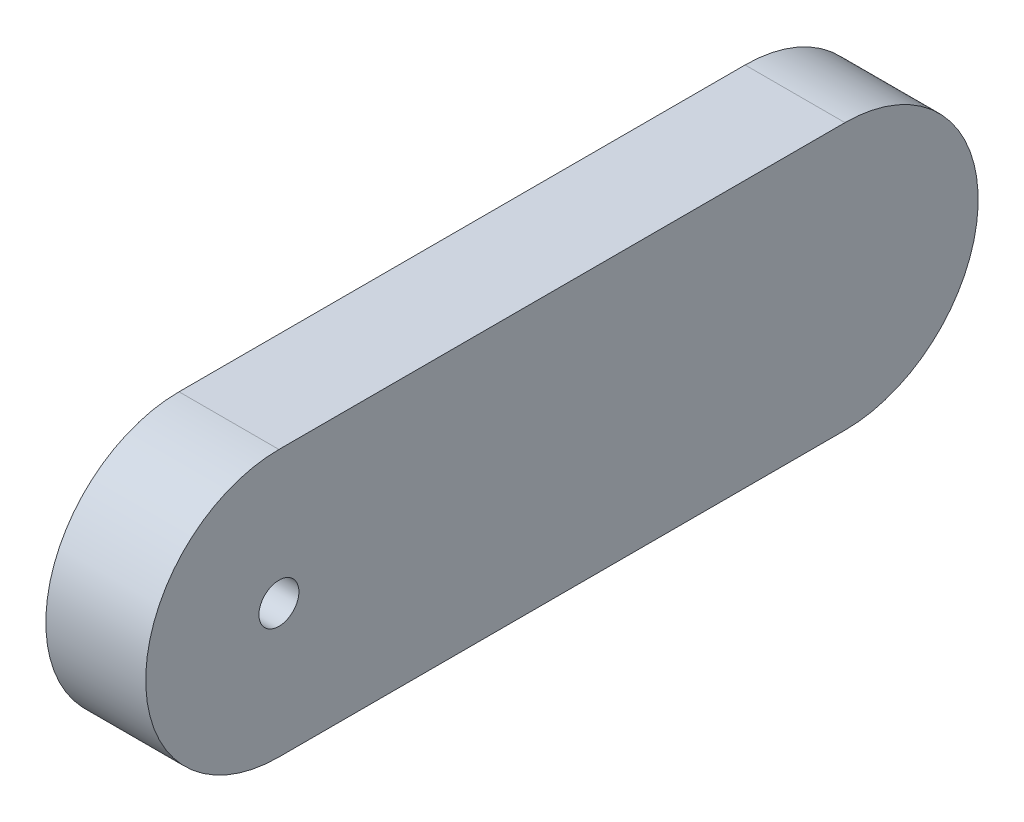
ISO-10303-21;
HEADER;
FILE_DESCRIPTION(('STEP AP214'),'2;1');
FILE_NAME('part.step','',(''),(''),'','','');
FILE_SCHEMA(('AUTOMOTIVE_DESIGN { 1 0 10303 214 1 1 1 1 }'));
ENDSEC;
DATA;
#1=APPLICATION_CONTEXT('core data for automotive mechanical design processes');
#2=APPLICATION_PROTOCOL_DEFINITION('international standard','automotive_design',2000,#1);
#3=PRODUCT_CONTEXT('',#1,'mechanical');
#4=PRODUCT('Part','Part','',(#3));
#5=PRODUCT_RELATED_PRODUCT_CATEGORY('part','',(#4));
#6=PRODUCT_DEFINITION_FORMATION('','',#4);
#7=PRODUCT_DEFINITION_CONTEXT('part definition',#1,'design');
#8=PRODUCT_DEFINITION('design','',#6,#7);
#9=PRODUCT_DEFINITION_SHAPE('','',#8);
#10=(LENGTH_UNIT() NAMED_UNIT(*) SI_UNIT(.MILLI.,.METRE.));
#11=(NAMED_UNIT(*) PLANE_ANGLE_UNIT() SI_UNIT($,.RADIAN.));
#12=(NAMED_UNIT(*) SI_UNIT($,.STERADIAN.) SOLID_ANGLE_UNIT());
#13=UNCERTAINTY_MEASURE_WITH_UNIT(LENGTH_MEASURE(1.E-05),#10,'distance_accuracy_value','');
#14=(GEOMETRIC_REPRESENTATION_CONTEXT(3) GLOBAL_UNCERTAINTY_ASSIGNED_CONTEXT((#13)) GLOBAL_UNIT_ASSIGNED_CONTEXT((#10,
#11,#12)) REPRESENTATION_CONTEXT('',''));
#15=CARTESIAN_POINT('',(0.,0.,0.));
#16=DIRECTION('',(0.,0.,1.));
#17=DIRECTION('',(1.,0.,0.));
#18=AXIS2_PLACEMENT_3D('',#15,#16,#17);
#19=CARTESIAN_POINT('',(30.,0.,-250.));
#20=DIRECTION('',(0.,1.,0.));
#21=DIRECTION('',(0.,0.,1.));
#22=AXIS2_PLACEMENT_3D('',#19,#20,#21);
#23=PLANE('',#22);
#24=DIRECTION('',(-1.,0.,0.));
#25=VECTOR('',#24,1.);
#26=CARTESIAN_POINT('',(30.,0.,-210.));
#27=LINE('',#26,#25);
#28=CARTESIAN_POINT('',(30.,0.,-210.));
#29=VERTEX_POINT('',#28);
#30=CARTESIAN_POINT('',(0.,0.,-210.));
#31=VERTEX_POINT('',#30);
#32=EDGE_CURVE('E11',#29,#31,#27,.T.);
#33=ORIENTED_EDGE('',*,*,#32,.F.);
#34=DIRECTION('',(0.,0.,-1.));
#35=VECTOR('',#34,1.);
#36=CARTESIAN_POINT('',(30.,0.,-250.));
#37=LINE('',#36,#35);
#38=CARTESIAN_POINT('',(30.,0.,-40.));
#39=VERTEX_POINT('',#38);
#40=EDGE_CURVE('E37',#39,#29,#37,.T.);
#41=ORIENTED_EDGE('',*,*,#40,.F.);
#42=DIRECTION('',(-1.,0.,0.));
#43=VECTOR('',#42,1.);
#44=CARTESIAN_POINT('',(30.,0.,-40.));
#45=LINE('',#44,#43);
#46=CARTESIAN_POINT('',(0.,0.,-40.));
#47=VERTEX_POINT('',#46);
#48=EDGE_CURVE('E87',#39,#47,#45,.T.);
#49=ORIENTED_EDGE('',*,*,#48,.T.);
#50=DIRECTION('',(0.,0.,-1.));
#51=VECTOR('',#50,1.);
#52=CARTESIAN_POINT('',(0.,0.,-250.));
#53=LINE('',#52,#51);
#54=EDGE_CURVE('E163',#47,#31,#53,.T.);
#55=ORIENTED_EDGE('',*,*,#54,.T.);
#56=EDGE_LOOP('',(#33,#41,#49,#55));
#57=FACE_BOUND('',#56,.T.);
#58=ADVANCED_FACE('F34',(#57),#23,.F.);
#59=CARTESIAN_POINT('',(30.,80.,0.));
#60=DIRECTION('',(0.,-1.,0.));
#61=DIRECTION('',(0.,0.,-1.));
#62=AXIS2_PLACEMENT_3D('',#59,#60,#61);
#63=PLANE('',#62);
#64=DIRECTION('',(0.,0.,1.));
#65=VECTOR('',#64,1.);
#66=CARTESIAN_POINT('',(30.,80.,0.));
#67=LINE('',#66,#65);
#68=CARTESIAN_POINT('',(30.,80.0000000000001,-210.));
#69=VERTEX_POINT('',#68);
#70=CARTESIAN_POINT('',(30.,80.,-40.));
#71=VERTEX_POINT('',#70);
#72=EDGE_CURVE('E174',#69,#71,#67,.T.);
#73=ORIENTED_EDGE('',*,*,#72,.F.);
#74=DIRECTION('',(-1.,0.,0.));
#75=VECTOR('',#74,1.);
#76=CARTESIAN_POINT('',(30.,80.0000000000001,-210.));
#77=LINE('',#76,#75);
#78=CARTESIAN_POINT('',(0.,80.0000000000001,-210.));
#79=VERTEX_POINT('',#78);
#80=EDGE_CURVE('E166',#69,#79,#77,.T.);
#81=ORIENTED_EDGE('',*,*,#80,.T.);
#82=DIRECTION('',(0.,0.,1.));
#83=VECTOR('',#82,1.);
#84=CARTESIAN_POINT('',(0.,80.,0.));
#85=LINE('',#84,#83);
#86=CARTESIAN_POINT('',(0.,80.,-40.));
#87=VERTEX_POINT('',#86);
#88=EDGE_CURVE('E169',#79,#87,#85,.T.);
#89=ORIENTED_EDGE('',*,*,#88,.T.);
#90=DIRECTION('',(-1.,0.,0.));
#91=VECTOR('',#90,1.);
#92=CARTESIAN_POINT('',(30.,80.,-40.));
#93=LINE('',#92,#91);
#94=EDGE_CURVE('E160',#71,#87,#93,.T.);
#95=ORIENTED_EDGE('',*,*,#94,.F.);
#96=EDGE_LOOP('',(#73,#81,#89,#95));
#97=FACE_BOUND('',#96,.T.);
#98=ADVANCED_FACE('F194',(#97),#63,.F.);
#99=CARTESIAN_POINT('',(30.,0.,0.));
#100=DIRECTION('',(-1.,0.,0.));
#101=DIRECTION('',(0.,0.,1.));
#102=AXIS2_PLACEMENT_3D('',#99,#100,#101);
#103=PLANE('',#102);
#104=CARTESIAN_POINT('',(30.,40.,-40.));
#105=DIRECTION('',(1.,0.,0.));
#106=DIRECTION('',(0.,0.,-1.));
#107=AXIS2_PLACEMENT_3D('',#104,#105,#106);
#108=CIRCLE('',#107,6.);
#109=CARTESIAN_POINT('',(30.,40.,-46.));
#110=VERTEX_POINT('',#109);
#111=EDGE_CURVE('E152',#110,#110,#108,.T.);
#112=ORIENTED_EDGE('',*,*,#111,.F.);
#113=EDGE_LOOP('',(#112));
#114=FACE_BOUND('',#113,.T.);
#115=CARTESIAN_POINT('',(30.,40.,-210.));
#116=DIRECTION('',(-1.,0.,0.));
#117=DIRECTION('',(0.,0.,1.));
#118=AXIS2_PLACEMENT_3D('',#115,#116,#117);
#119=CIRCLE('',#118,40.);
#120=EDGE_CURVE('E42',#69,#29,#119,.T.);
#121=ORIENTED_EDGE('',*,*,#120,.F.);
#122=ORIENTED_EDGE('',*,*,#72,.T.);
#123=CARTESIAN_POINT('',(30.,40.,-40.));
#124=DIRECTION('',(-1.,0.,0.));
#125=DIRECTION('',(0.,0.,1.));
#126=AXIS2_PLACEMENT_3D('',#123,#124,#125);
#127=CIRCLE('',#126,40.);
#128=EDGE_CURVE('E155',#39,#71,#127,.T.);
#129=ORIENTED_EDGE('',*,*,#128,.F.);
#130=ORIENTED_EDGE('',*,*,#40,.T.);
#131=EDGE_LOOP('',(#121,#122,#129,#130));
#132=FACE_BOUND('',#131,.T.);
#133=ADVANCED_FACE('F198',(#114,#132),#103,.F.);
#134=CARTESIAN_POINT('',(0.,0.,0.));
#135=DIRECTION('',(-1.,0.,0.));
#136=DIRECTION('',(0.,0.,1.));
#137=AXIS2_PLACEMENT_3D('',#134,#135,#136);
#138=PLANE('',#137);
#139=DIRECTION('',(0.,-1.,0.));
#140=VECTOR('',#139,1.);
#141=CARTESIAN_POINT('',(0.,50.0000000000001,-220.));
#142=LINE('',#141,#140);
#143=CARTESIAN_POINT('',(0.,50.0000000000001,-220.));
#144=VERTEX_POINT('',#143);
#145=CARTESIAN_POINT('',(0.,30.0000000000001,-220.));
#146=VERTEX_POINT('',#145);
#147=EDGE_CURVE('E50',#144,#146,#142,.T.);
#148=ORIENTED_EDGE('',*,*,#147,.F.);
#149=DIRECTION('',(0.,0.,-1.));
#150=VECTOR('',#149,1.);
#151=CARTESIAN_POINT('',(0.,50.0000000000001,-220.));
#152=LINE('',#151,#150);
#153=CARTESIAN_POINT('',(0.,50.0000000000001,-180.));
#154=VERTEX_POINT('',#153);
#155=EDGE_CURVE('E140',#154,#144,#152,.T.);
#156=ORIENTED_EDGE('',*,*,#155,.F.);
#157=DIRECTION('',(0.,1.,0.));
#158=VECTOR('',#157,1.);
#159=CARTESIAN_POINT('',(0.,50.0000000000001,-180.));
#160=LINE('',#159,#158);
#161=CARTESIAN_POINT('',(0.,30.0000000000001,-180.));
#162=VERTEX_POINT('',#161);
#163=EDGE_CURVE('E146',#162,#154,#160,.T.);
#164=ORIENTED_EDGE('',*,*,#163,.F.);
#165=DIRECTION('',(0.,0.,1.));
#166=VECTOR('',#165,1.);
#167=CARTESIAN_POINT('',(0.,30.0000000000001,-220.));
#168=LINE('',#167,#166);
#169=EDGE_CURVE('E124',#146,#162,#168,.T.);
#170=ORIENTED_EDGE('',*,*,#169,.F.);
#171=EDGE_LOOP('',(#148,#156,#164,#170));
#172=FACE_BOUND('',#171,.T.);
#173=CARTESIAN_POINT('',(0.,40.,-40.));
#174=DIRECTION('',(1.,0.,0.));
#175=DIRECTION('',(0.,0.,-1.));
#176=AXIS2_PLACEMENT_3D('',#173,#174,#175);
#177=CIRCLE('',#176,6.);
#178=CARTESIAN_POINT('',(0.,40.,-46.));
#179=VERTEX_POINT('',#178);
#180=EDGE_CURVE('E156',#179,#179,#177,.T.);
#181=ORIENTED_EDGE('',*,*,#180,.T.);
#182=EDGE_LOOP('',(#181));
#183=FACE_BOUND('',#182,.T.);
#184=ORIENTED_EDGE('',*,*,#88,.F.);
#185=CARTESIAN_POINT('',(0.,40.,-210.));
#186=DIRECTION('',(-1.,0.,0.));
#187=DIRECTION('',(0.,0.,1.));
#188=AXIS2_PLACEMENT_3D('',#185,#186,#187);
#189=CIRCLE('',#188,40.);
#190=EDGE_CURVE('E159',#79,#31,#189,.T.);
#191=ORIENTED_EDGE('',*,*,#190,.T.);
#192=ORIENTED_EDGE('',*,*,#54,.F.);
#193=CARTESIAN_POINT('',(0.,40.,-40.));
#194=DIRECTION('',(-1.,0.,0.));
#195=DIRECTION('',(0.,0.,1.));
#196=AXIS2_PLACEMENT_3D('',#193,#194,#195);
#197=CIRCLE('',#196,40.);
#198=EDGE_CURVE('E77',#47,#87,#197,.T.);
#199=ORIENTED_EDGE('',*,*,#198,.T.);
#200=EDGE_LOOP('',(#184,#191,#192,#199));
#201=FACE_BOUND('',#200,.T.);
#202=ADVANCED_FACE('F178',(#172,#183,#201),#138,.T.);
#203=CARTESIAN_POINT('',(0.,40.,-40.));
#204=DIRECTION('',(1.,0.,0.));
#205=DIRECTION('',(0.,0.,-1.));
#206=AXIS2_PLACEMENT_3D('',#203,#204,#205);
#207=CYLINDRICAL_SURFACE('',#206,6.);
#208=ORIENTED_EDGE('',*,*,#180,.F.);
#209=EDGE_LOOP('',(#208));
#210=FACE_BOUND('',#209,.T.);
#211=ORIENTED_EDGE('',*,*,#111,.T.);
#212=EDGE_LOOP('',(#211));
#213=FACE_BOUND('',#212,.T.);
#214=ADVANCED_FACE('F190',(#210,#213),#207,.F.);
#215=CARTESIAN_POINT('',(30.,40.,-40.));
#216=DIRECTION('',(-1.,0.,0.));
#217=DIRECTION('',(0.,0.,1.));
#218=AXIS2_PLACEMENT_3D('',#215,#216,#217);
#219=CYLINDRICAL_SURFACE('',#218,40.);
#220=ORIENTED_EDGE('',*,*,#128,.T.);
#221=ORIENTED_EDGE('',*,*,#94,.T.);
#222=ORIENTED_EDGE('',*,*,#198,.F.);
#223=ORIENTED_EDGE('',*,*,#48,.F.);
#224=EDGE_LOOP('',(#220,#221,#222,#223));
#225=FACE_BOUND('',#224,.T.);
#226=ADVANCED_FACE('F182',(#225),#219,.T.);
#227=CARTESIAN_POINT('',(30.,40.,-210.));
#228=DIRECTION('',(-1.,0.,0.));
#229=DIRECTION('',(0.,0.,1.));
#230=AXIS2_PLACEMENT_3D('',#227,#228,#229);
#231=CYLINDRICAL_SURFACE('',#230,40.);
#232=ORIENTED_EDGE('',*,*,#120,.T.);
#233=ORIENTED_EDGE('',*,*,#32,.T.);
#234=ORIENTED_EDGE('',*,*,#190,.F.);
#235=ORIENTED_EDGE('',*,*,#80,.F.);
#236=EDGE_LOOP('',(#232,#233,#234,#235));
#237=FACE_BOUND('',#236,.T.);
#238=ADVANCED_FACE('F179',(#237),#231,.T.);
#239=CARTESIAN_POINT('',(25.,50.0000000000001,-220.));
#240=DIRECTION('',(0.,0.,-1.));
#241=DIRECTION('',(-1.,0.,0.));
#242=AXIS2_PLACEMENT_3D('',#239,#240,#241);
#243=PLANE('',#242);
#244=ORIENTED_EDGE('',*,*,#147,.T.);
#245=DIRECTION('',(-1.,0.,0.));
#246=VECTOR('',#245,1.);
#247=CARTESIAN_POINT('',(25.,30.0000000000001,-220.));
#248=LINE('',#247,#246);
#249=CARTESIAN_POINT('',(25.,30.0000000000001,-220.));
#250=VERTEX_POINT('',#249);
#251=EDGE_CURVE('E112',#250,#146,#248,.T.);
#252=ORIENTED_EDGE('',*,*,#251,.F.);
#253=DIRECTION('',(0.,-1.,0.));
#254=VECTOR('',#253,1.);
#255=CARTESIAN_POINT('',(25.,50.0000000000001,-220.));
#256=LINE('',#255,#254);
#257=CARTESIAN_POINT('',(25.,50.0000000000001,-220.));
#258=VERTEX_POINT('',#257);
#259=EDGE_CURVE('E138',#258,#250,#256,.T.);
#260=ORIENTED_EDGE('',*,*,#259,.F.);
#261=DIRECTION('',(-1.,0.,0.));
#262=VECTOR('',#261,1.);
#263=CARTESIAN_POINT('',(25.,50.0000000000001,-220.));
#264=LINE('',#263,#262);
#265=EDGE_CURVE('E96',#258,#144,#264,.T.);
#266=ORIENTED_EDGE('',*,*,#265,.T.);
#267=EDGE_LOOP('',(#244,#252,#260,#266));
#268=FACE_BOUND('',#267,.T.);
#269=ADVANCED_FACE('F181',(#268),#243,.F.);
#270=CARTESIAN_POINT('',(25.,50.0000000000001,-220.));
#271=DIRECTION('',(0.,1.,0.));
#272=DIRECTION('',(0.,0.,1.));
#273=AXIS2_PLACEMENT_3D('',#270,#271,#272);
#274=PLANE('',#273);
#275=ORIENTED_EDGE('',*,*,#155,.T.);
#276=ORIENTED_EDGE('',*,*,#265,.F.);
#277=DIRECTION('',(0.,0.,-1.));
#278=VECTOR('',#277,1.);
#279=CARTESIAN_POINT('',(25.,50.0000000000001,-220.));
#280=LINE('',#279,#278);
#281=CARTESIAN_POINT('',(25.,50.0000000000001,-180.));
#282=VERTEX_POINT('',#281);
#283=EDGE_CURVE('E135',#282,#258,#280,.T.);
#284=ORIENTED_EDGE('',*,*,#283,.F.);
#285=DIRECTION('',(-1.,0.,0.));
#286=VECTOR('',#285,1.);
#287=CARTESIAN_POINT('',(25.,50.0000000000001,-180.));
#288=LINE('',#287,#286);
#289=EDGE_CURVE('E128',#282,#154,#288,.T.);
#290=ORIENTED_EDGE('',*,*,#289,.T.);
#291=EDGE_LOOP('',(#275,#276,#284,#290));
#292=FACE_BOUND('',#291,.T.);
#293=ADVANCED_FACE('F188',(#292),#274,.F.);
#294=CARTESIAN_POINT('',(25.,50.0000000000001,-180.));
#295=DIRECTION('',(0.,0.,1.));
#296=DIRECTION('',(1.,0.,0.));
#297=AXIS2_PLACEMENT_3D('',#294,#295,#296);
#298=PLANE('',#297);
#299=ORIENTED_EDGE('',*,*,#163,.T.);
#300=ORIENTED_EDGE('',*,*,#289,.F.);
#301=DIRECTION('',(0.,1.,0.));
#302=VECTOR('',#301,1.);
#303=CARTESIAN_POINT('',(25.,50.0000000000001,-180.));
#304=LINE('',#303,#302);
#305=CARTESIAN_POINT('',(25.,30.0000000000001,-180.));
#306=VERTEX_POINT('',#305);
#307=EDGE_CURVE('E131',#306,#282,#304,.T.);
#308=ORIENTED_EDGE('',*,*,#307,.F.);
#309=DIRECTION('',(-1.,0.,0.));
#310=VECTOR('',#309,1.);
#311=CARTESIAN_POINT('',(25.,30.0000000000001,-180.));
#312=LINE('',#311,#310);
#313=EDGE_CURVE('E117',#306,#162,#312,.T.);
#314=ORIENTED_EDGE('',*,*,#313,.T.);
#315=EDGE_LOOP('',(#299,#300,#308,#314));
#316=FACE_BOUND('',#315,.T.);
#317=ADVANCED_FACE('F132',(#316),#298,.F.);
#318=CARTESIAN_POINT('',(25.,30.0000000000001,-220.));
#319=DIRECTION('',(0.,-1.,0.));
#320=DIRECTION('',(0.,0.,-1.));
#321=AXIS2_PLACEMENT_3D('',#318,#319,#320);
#322=PLANE('',#321);
#323=ORIENTED_EDGE('',*,*,#169,.T.);
#324=ORIENTED_EDGE('',*,*,#313,.F.);
#325=DIRECTION('',(0.,0.,1.));
#326=VECTOR('',#325,1.);
#327=CARTESIAN_POINT('',(25.,30.0000000000001,-220.));
#328=LINE('',#327,#326);
#329=EDGE_CURVE('E121',#250,#306,#328,.T.);
#330=ORIENTED_EDGE('',*,*,#329,.F.);
#331=ORIENTED_EDGE('',*,*,#251,.T.);
#332=EDGE_LOOP('',(#323,#324,#330,#331));
#333=FACE_BOUND('',#332,.T.);
#334=ADVANCED_FACE('F119',(#333),#322,.F.);
#335=CARTESIAN_POINT('',(25.,0.,0.));
#336=DIRECTION('',(-1.,0.,0.));
#337=DIRECTION('',(0.,0.,1.));
#338=AXIS2_PLACEMENT_3D('',#335,#336,#337);
#339=PLANE('',#338);
#340=ORIENTED_EDGE('',*,*,#259,.T.);
#341=ORIENTED_EDGE('',*,*,#329,.T.);
#342=ORIENTED_EDGE('',*,*,#307,.T.);
#343=ORIENTED_EDGE('',*,*,#283,.T.);
#344=EDGE_LOOP('',(#340,#341,#342,#343));
#345=FACE_BOUND('',#344,.T.);
#346=ADVANCED_FACE('F137',(#345),#339,.T.);
#347=CLOSED_SHELL('',(#58,#98,#133,#202,#214,#226,#238,#269,#293,#317,#334,#346));
#348=MANIFOLD_SOLID_BREP('B2',#347);
#349=ADVANCED_BREP_SHAPE_REPRESENTATION('',(#18,#348),#14);
#350=SHAPE_DEFINITION_REPRESENTATION(#9,#349);
ENDSEC;
END-ISO-10303-21;
